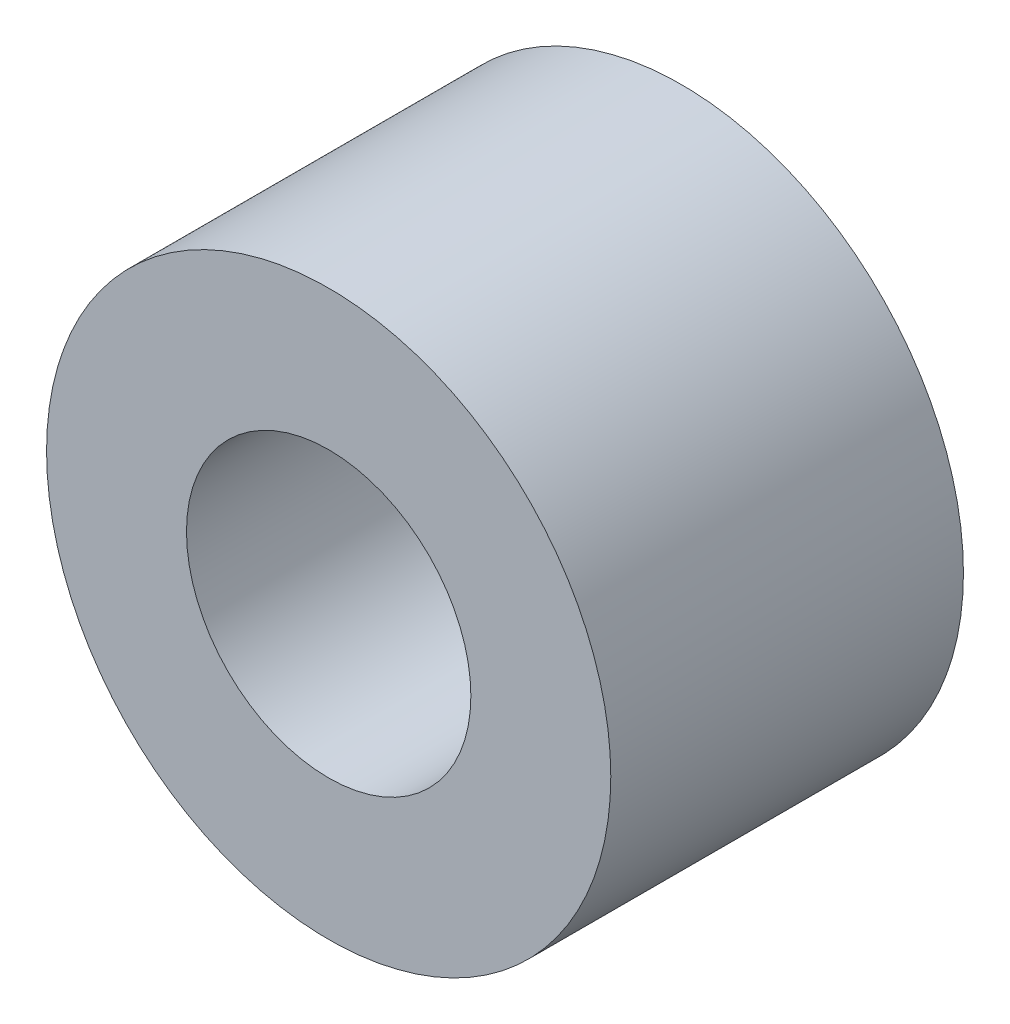
ISO-10303-21;
HEADER;
FILE_DESCRIPTION(('STEP AP214'),'2;1');
FILE_NAME('part.step','',(''),(''),'','','');
FILE_SCHEMA(('AUTOMOTIVE_DESIGN { 1 0 10303 214 1 1 1 1 }'));
ENDSEC;
DATA;
#1=APPLICATION_CONTEXT('core data for automotive mechanical design processes');
#2=APPLICATION_PROTOCOL_DEFINITION('international standard','automotive_design',2000,#1);
#3=PRODUCT_CONTEXT('',#1,'mechanical');
#4=PRODUCT('Part','Part','',(#3));
#5=PRODUCT_RELATED_PRODUCT_CATEGORY('part','',(#4));
#6=PRODUCT_DEFINITION_FORMATION('','',#4);
#7=PRODUCT_DEFINITION_CONTEXT('part definition',#1,'design');
#8=PRODUCT_DEFINITION('design','',#6,#7);
#9=PRODUCT_DEFINITION_SHAPE('','',#8);
#10=(LENGTH_UNIT() NAMED_UNIT(*) SI_UNIT(.MILLI.,.METRE.));
#11=(NAMED_UNIT(*) PLANE_ANGLE_UNIT() SI_UNIT($,.RADIAN.));
#12=(NAMED_UNIT(*) SI_UNIT($,.STERADIAN.) SOLID_ANGLE_UNIT());
#13=UNCERTAINTY_MEASURE_WITH_UNIT(LENGTH_MEASURE(1.E-05),#10,'distance_accuracy_value','');
#14=(GEOMETRIC_REPRESENTATION_CONTEXT(3) GLOBAL_UNCERTAINTY_ASSIGNED_CONTEXT((#13)) GLOBAL_UNIT_ASSIGNED_CONTEXT((#10,
#11,#12)) REPRESENTATION_CONTEXT('',''));
#15=CARTESIAN_POINT('',(0.,0.,0.));
#16=DIRECTION('',(0.,0.,1.));
#17=DIRECTION('',(1.,0.,0.));
#18=AXIS2_PLACEMENT_3D('',#15,#16,#17);
#19=CARTESIAN_POINT('',(0.,0.,3.96875));
#20=DIRECTION('',(0.,0.,1.));
#21=DIRECTION('',(1.,0.,0.));
#22=AXIS2_PLACEMENT_3D('',#19,#20,#21);
#23=PLANE('',#22);
#24=CARTESIAN_POINT('',(0.,0.,3.96875));
#25=DIRECTION('',(0.,0.,1.));
#26=DIRECTION('',(1.,0.,0.));
#27=AXIS2_PLACEMENT_3D('',#24,#25,#26);
#28=CIRCLE('',#27,6.35);
#29=CARTESIAN_POINT('',(6.35,0.,3.96875));
#30=VERTEX_POINT('',#29);
#31=EDGE_CURVE('E10',#30,#30,#28,.T.);
#32=ORIENTED_EDGE('',*,*,#31,.T.);
#33=EDGE_LOOP('',(#32));
#34=FACE_BOUND('',#33,.T.);
#35=CARTESIAN_POINT('',(0.,0.,3.96875));
#36=DIRECTION('',(0.,0.,1.));
#37=DIRECTION('',(1.,0.,0.));
#38=AXIS2_PLACEMENT_3D('',#35,#36,#37);
#39=CIRCLE('',#38,3.2004);
#40=CARTESIAN_POINT('',(3.2004,0.,3.96875));
#41=VERTEX_POINT('',#40);
#42=EDGE_CURVE('E41',#41,#41,#39,.T.);
#43=ORIENTED_EDGE('',*,*,#42,.F.);
#44=EDGE_LOOP('',(#43));
#45=FACE_BOUND('',#44,.T.);
#46=ADVANCED_FACE('F30',(#34,#45),#23,.T.);
#47=CARTESIAN_POINT('',(0.,0.,-3.96875));
#48=DIRECTION('',(0.,0.,1.));
#49=DIRECTION('',(1.,0.,0.));
#50=AXIS2_PLACEMENT_3D('',#47,#48,#49);
#51=PLANE('',#50);
#52=CARTESIAN_POINT('',(0.,0.,-3.96875));
#53=DIRECTION('',(0.,0.,1.));
#54=DIRECTION('',(1.,0.,0.));
#55=AXIS2_PLACEMENT_3D('',#52,#53,#54);
#56=CIRCLE('',#55,6.35);
#57=CARTESIAN_POINT('',(6.35,0.,-3.96875));
#58=VERTEX_POINT('',#57);
#59=EDGE_CURVE('E34',#58,#58,#56,.T.);
#60=ORIENTED_EDGE('',*,*,#59,.F.);
#61=EDGE_LOOP('',(#60));
#62=FACE_BOUND('',#61,.T.);
#63=CARTESIAN_POINT('',(0.,0.,-3.96875));
#64=DIRECTION('',(0.,0.,1.));
#65=DIRECTION('',(1.,0.,0.));
#66=AXIS2_PLACEMENT_3D('',#63,#64,#65);
#67=CIRCLE('',#66,3.2004);
#68=CARTESIAN_POINT('',(3.2004,0.,-3.96875));
#69=VERTEX_POINT('',#68);
#70=EDGE_CURVE('E43',#69,#69,#67,.T.);
#71=ORIENTED_EDGE('',*,*,#70,.T.);
#72=EDGE_LOOP('',(#71));
#73=FACE_BOUND('',#72,.T.);
#74=ADVANCED_FACE('F53',(#62,#73),#51,.F.);
#75=CARTESIAN_POINT('',(0.,0.,3.96875));
#76=DIRECTION('',(0.,0.,-1.));
#77=DIRECTION('',(-1.,0.,0.));
#78=AXIS2_PLACEMENT_3D('',#75,#76,#77);
#79=CYLINDRICAL_SURFACE('',#78,6.35);
#80=ORIENTED_EDGE('',*,*,#31,.F.);
#81=EDGE_LOOP('',(#80));
#82=FACE_BOUND('',#81,.T.);
#83=ORIENTED_EDGE('',*,*,#59,.T.);
#84=EDGE_LOOP('',(#83));
#85=FACE_BOUND('',#84,.T.);
#86=ADVANCED_FACE('F32',(#82,#85),#79,.T.);
#87=CARTESIAN_POINT('',(0.,0.,3.96875));
#88=DIRECTION('',(0.,0.,-1.));
#89=DIRECTION('',(-1.,0.,0.));
#90=AXIS2_PLACEMENT_3D('',#87,#88,#89);
#91=CYLINDRICAL_SURFACE('',#90,3.2004);
#92=ORIENTED_EDGE('',*,*,#42,.T.);
#93=EDGE_LOOP('',(#92));
#94=FACE_BOUND('',#93,.T.);
#95=ORIENTED_EDGE('',*,*,#70,.F.);
#96=EDGE_LOOP('',(#95));
#97=FACE_BOUND('',#96,.T.);
#98=ADVANCED_FACE('F49',(#94,#97),#91,.F.);
#99=CLOSED_SHELL('',(#46,#74,#86,#98));
#100=MANIFOLD_SOLID_BREP('B2',#99);
#101=ADVANCED_BREP_SHAPE_REPRESENTATION('',(#18,#100),#14);
#102=SHAPE_DEFINITION_REPRESENTATION(#9,#101);
ENDSEC;
END-ISO-10303-21;
